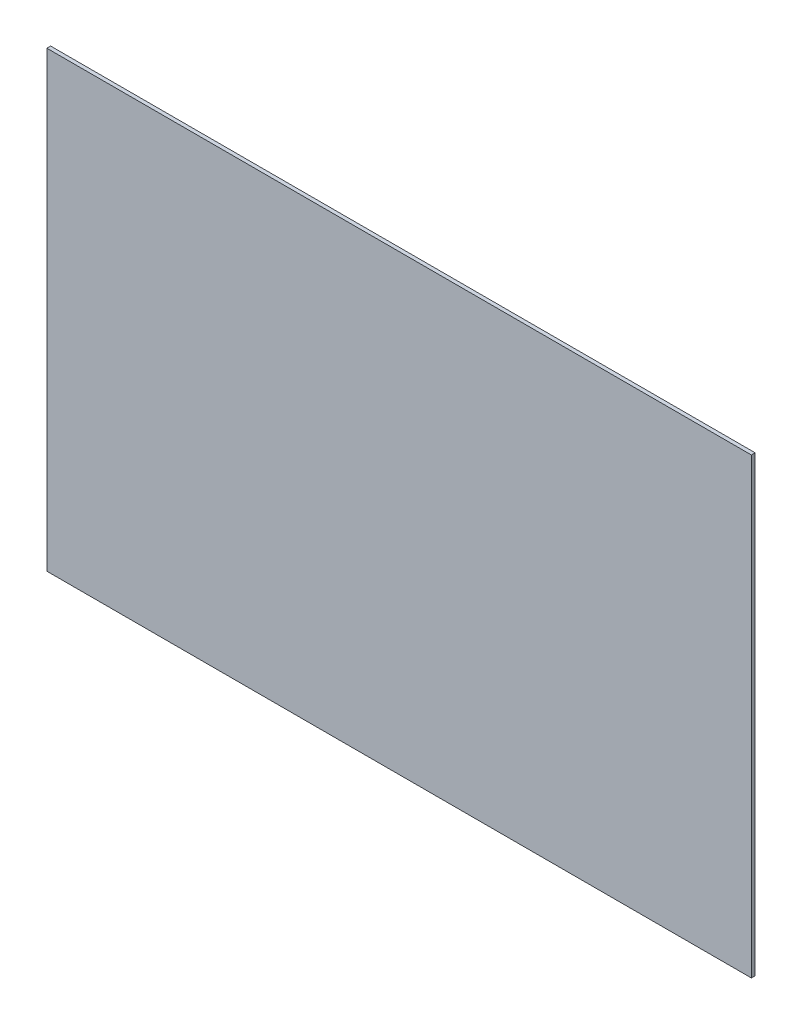
ISO-10303-21;
HEADER;
FILE_DESCRIPTION(('STEP AP214'),'2;1');
FILE_NAME('part.step','',(''),(''),'','','');
FILE_SCHEMA(('AUTOMOTIVE_DESIGN { 1 0 10303 214 1 1 1 1 }'));
ENDSEC;
DATA;
#1=APPLICATION_CONTEXT('core data for automotive mechanical design processes');
#2=APPLICATION_PROTOCOL_DEFINITION('international standard','automotive_design',2000,#1);
#3=PRODUCT_CONTEXT('',#1,'mechanical');
#4=PRODUCT('Part','Part','',(#3));
#5=PRODUCT_RELATED_PRODUCT_CATEGORY('part','',(#4));
#6=PRODUCT_DEFINITION_FORMATION('','',#4);
#7=PRODUCT_DEFINITION_CONTEXT('part definition',#1,'design');
#8=PRODUCT_DEFINITION('design','',#6,#7);
#9=PRODUCT_DEFINITION_SHAPE('','',#8);
#10=(LENGTH_UNIT() NAMED_UNIT(*) SI_UNIT(.MILLI.,.METRE.));
#11=(NAMED_UNIT(*) PLANE_ANGLE_UNIT() SI_UNIT($,.RADIAN.));
#12=(NAMED_UNIT(*) SI_UNIT($,.STERADIAN.) SOLID_ANGLE_UNIT());
#13=UNCERTAINTY_MEASURE_WITH_UNIT(LENGTH_MEASURE(1.E-05),#10,'distance_accuracy_value','');
#14=(GEOMETRIC_REPRESENTATION_CONTEXT(3) GLOBAL_UNCERTAINTY_ASSIGNED_CONTEXT((#13)) GLOBAL_UNIT_ASSIGNED_CONTEXT((#10,
#11,#12)) REPRESENTATION_CONTEXT('',''));
#15=CARTESIAN_POINT('',(0.,0.,0.));
#16=DIRECTION('',(0.,0.,1.));
#17=DIRECTION('',(1.,0.,0.));
#18=AXIS2_PLACEMENT_3D('',#15,#16,#17);
#19=CARTESIAN_POINT('',(0.,180.,1.5));
#20=DIRECTION('',(0.,0.,-1.));
#21=DIRECTION('',(-1.,0.,0.));
#22=AXIS2_PLACEMENT_3D('',#19,#20,#21);
#23=PLANE('',#22);
#24=DIRECTION('',(1.,0.,0.));
#25=VECTOR('',#24,1.);
#26=CARTESIAN_POINT('',(0.,0.,1.5));
#27=LINE('',#26,#25);
#28=CARTESIAN_POINT('',(0.,0.,1.5));
#29=VERTEX_POINT('',#28);
#30=CARTESIAN_POINT('',(280.,0.,1.5));
#31=VERTEX_POINT('',#30);
#32=EDGE_CURVE('E101',#29,#31,#27,.T.);
#33=ORIENTED_EDGE('',*,*,#32,.T.);
#34=DIRECTION('',(0.,-1.,0.));
#35=VECTOR('',#34,1.);
#36=CARTESIAN_POINT('',(280.,180.,1.5));
#37=LINE('',#36,#35);
#38=CARTESIAN_POINT('',(280.,180.,1.5));
#39=VERTEX_POINT('',#38);
#40=EDGE_CURVE('E11',#39,#31,#37,.T.);
#41=ORIENTED_EDGE('',*,*,#40,.F.);
#42=DIRECTION('',(1.,0.,0.));
#43=VECTOR('',#42,1.);
#44=CARTESIAN_POINT('',(0.,180.,1.5));
#45=LINE('',#44,#43);
#46=CARTESIAN_POINT('',(0.,180.,1.5));
#47=VERTEX_POINT('',#46);
#48=EDGE_CURVE('E78',#47,#39,#45,.T.);
#49=ORIENTED_EDGE('',*,*,#48,.F.);
#50=DIRECTION('',(0.,-1.,0.));
#51=VECTOR('',#50,1.);
#52=CARTESIAN_POINT('',(0.,180.,1.5));
#53=LINE('',#52,#51);
#54=EDGE_CURVE('E54',#47,#29,#53,.T.);
#55=ORIENTED_EDGE('',*,*,#54,.T.);
#56=EDGE_LOOP('',(#33,#41,#49,#55));
#57=FACE_BOUND('',#56,.T.);
#58=ADVANCED_FACE('F38',(#57),#23,.F.);
#59=CARTESIAN_POINT('',(280.,180.,0.));
#60=DIRECTION('',(1.,0.,0.));
#61=DIRECTION('',(0.,0.,-1.));
#62=AXIS2_PLACEMENT_3D('',#59,#60,#61);
#63=PLANE('',#62);
#64=DIRECTION('',(0.,0.,1.));
#65=VECTOR('',#64,1.);
#66=CARTESIAN_POINT('',(280.,0.,0.));
#67=LINE('',#66,#65);
#68=CARTESIAN_POINT('',(280.,0.,0.));
#69=VERTEX_POINT('',#68);
#70=EDGE_CURVE('E87',#69,#31,#67,.T.);
#71=ORIENTED_EDGE('',*,*,#70,.F.);
#72=DIRECTION('',(0.,-1.,0.));
#73=VECTOR('',#72,1.);
#74=CARTESIAN_POINT('',(280.,180.,0.));
#75=LINE('',#74,#73);
#76=CARTESIAN_POINT('',(280.,180.,0.));
#77=VERTEX_POINT('',#76);
#78=EDGE_CURVE('E46',#77,#69,#75,.T.);
#79=ORIENTED_EDGE('',*,*,#78,.F.);
#80=DIRECTION('',(0.,0.,1.));
#81=VECTOR('',#80,1.);
#82=CARTESIAN_POINT('',(280.,180.,0.));
#83=LINE('',#82,#81);
#84=EDGE_CURVE('E85',#77,#39,#83,.T.);
#85=ORIENTED_EDGE('',*,*,#84,.T.);
#86=ORIENTED_EDGE('',*,*,#40,.T.);
#87=EDGE_LOOP('',(#71,#79,#85,#86));
#88=FACE_BOUND('',#87,.T.);
#89=ADVANCED_FACE('F84',(#88),#63,.T.);
#90=CARTESIAN_POINT('',(0.,180.,0.));
#91=DIRECTION('',(0.,0.,-1.));
#92=DIRECTION('',(-1.,0.,0.));
#93=AXIS2_PLACEMENT_3D('',#90,#91,#92);
#94=PLANE('',#93);
#95=DIRECTION('',(1.,0.,0.));
#96=VECTOR('',#95,1.);
#97=CARTESIAN_POINT('',(0.,0.,0.));
#98=LINE('',#97,#96);
#99=CARTESIAN_POINT('',(0.,0.,0.));
#100=VERTEX_POINT('',#99);
#101=EDGE_CURVE('E104',#100,#69,#98,.T.);
#102=ORIENTED_EDGE('',*,*,#101,.F.);
#103=DIRECTION('',(0.,-1.,0.));
#104=VECTOR('',#103,1.);
#105=CARTESIAN_POINT('',(0.,180.,0.));
#106=LINE('',#105,#104);
#107=CARTESIAN_POINT('',(0.,180.,0.));
#108=VERTEX_POINT('',#107);
#109=EDGE_CURVE('E67',#108,#100,#106,.T.);
#110=ORIENTED_EDGE('',*,*,#109,.F.);
#111=DIRECTION('',(1.,0.,0.));
#112=VECTOR('',#111,1.);
#113=CARTESIAN_POINT('',(0.,180.,0.));
#114=LINE('',#113,#112);
#115=EDGE_CURVE('E93',#108,#77,#114,.T.);
#116=ORIENTED_EDGE('',*,*,#115,.T.);
#117=ORIENTED_EDGE('',*,*,#78,.T.);
#118=EDGE_LOOP('',(#102,#110,#116,#117));
#119=FACE_BOUND('',#118,.T.);
#120=ADVANCED_FACE('F95',(#119),#94,.T.);
#121=CARTESIAN_POINT('',(0.,180.,1.5));
#122=DIRECTION('',(-1.,0.,0.));
#123=DIRECTION('',(0.,0.,1.));
#124=AXIS2_PLACEMENT_3D('',#121,#122,#123);
#125=PLANE('',#124);
#126=DIRECTION('',(0.,0.,-1.));
#127=VECTOR('',#126,1.);
#128=CARTESIAN_POINT('',(0.,0.,1.5));
#129=LINE('',#128,#127);
#130=EDGE_CURVE('E106',#29,#100,#129,.T.);
#131=ORIENTED_EDGE('',*,*,#130,.F.);
#132=ORIENTED_EDGE('',*,*,#54,.F.);
#133=DIRECTION('',(0.,0.,-1.));
#134=VECTOR('',#133,1.);
#135=CARTESIAN_POINT('',(0.,180.,1.5));
#136=LINE('',#135,#134);
#137=EDGE_CURVE('E96',#47,#108,#136,.T.);
#138=ORIENTED_EDGE('',*,*,#137,.T.);
#139=ORIENTED_EDGE('',*,*,#109,.T.);
#140=EDGE_LOOP('',(#131,#132,#138,#139));
#141=FACE_BOUND('',#140,.T.);
#142=ADVANCED_FACE('F112',(#141),#125,.T.);
#143=CARTESIAN_POINT('',(0.,180.,0.));
#144=DIRECTION('',(0.,-1.,0.));
#145=DIRECTION('',(-1.,0.,0.));
#146=AXIS2_PLACEMENT_3D('',#143,#144,#145);
#147=PLANE('',#146);
#148=ORIENTED_EDGE('',*,*,#48,.T.);
#149=ORIENTED_EDGE('',*,*,#84,.F.);
#150=ORIENTED_EDGE('',*,*,#115,.F.);
#151=ORIENTED_EDGE('',*,*,#137,.F.);
#152=EDGE_LOOP('',(#148,#149,#150,#151));
#153=FACE_BOUND('',#152,.T.);
#154=ADVANCED_FACE('F92',(#153),#147,.F.);
#155=CARTESIAN_POINT('',(0.,0.,0.));
#156=DIRECTION('',(0.,-1.,0.));
#157=DIRECTION('',(-1.,0.,0.));
#158=AXIS2_PLACEMENT_3D('',#155,#156,#157);
#159=PLANE('',#158);
#160=ORIENTED_EDGE('',*,*,#32,.F.);
#161=ORIENTED_EDGE('',*,*,#130,.T.);
#162=ORIENTED_EDGE('',*,*,#101,.T.);
#163=ORIENTED_EDGE('',*,*,#70,.T.);
#164=EDGE_LOOP('',(#160,#161,#162,#163));
#165=FACE_BOUND('',#164,.T.);
#166=ADVANCED_FACE('F111',(#165),#159,.T.);
#167=CLOSED_SHELL('',(#58,#89,#120,#142,#154,#166));
#168=MANIFOLD_SOLID_BREP('B2',#167);
#169=ADVANCED_BREP_SHAPE_REPRESENTATION('',(#18,#168),#14);
#170=SHAPE_DEFINITION_REPRESENTATION(#9,#169);
ENDSEC;
END-ISO-10303-21;
